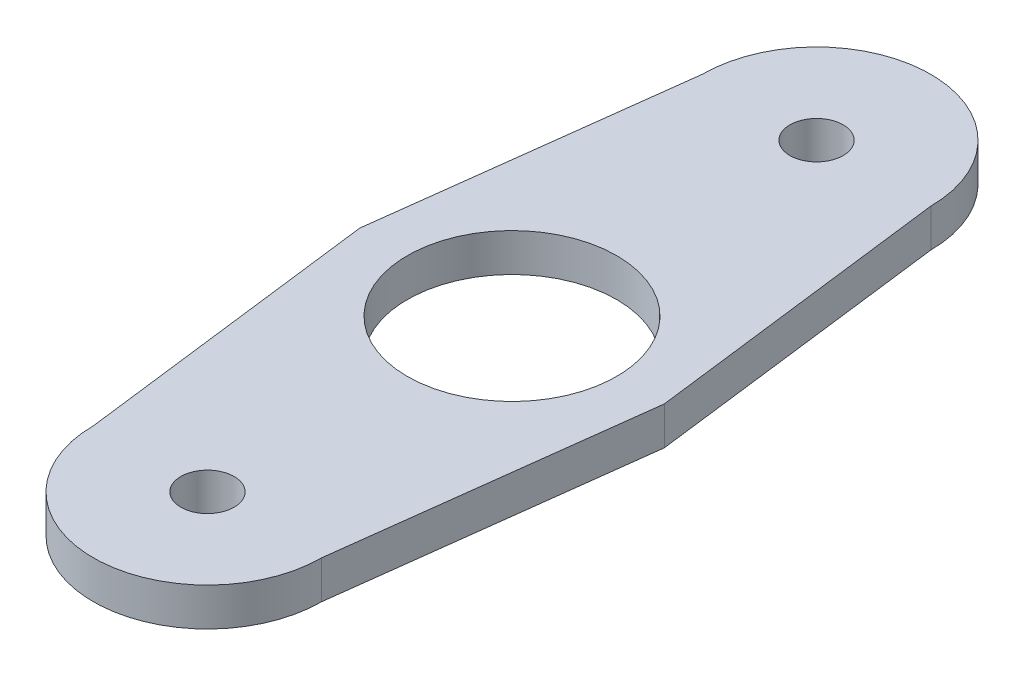
ISO-10303-21;
HEADER;
FILE_DESCRIPTION(('STEP AP214'),'2;1');
FILE_NAME('part.step','',(''),(''),'','','');
FILE_SCHEMA(('AUTOMOTIVE_DESIGN { 1 0 10303 214 1 1 1 1 }'));
ENDSEC;
DATA;
#1=APPLICATION_CONTEXT('core data for automotive mechanical design processes');
#2=APPLICATION_PROTOCOL_DEFINITION('international standard','automotive_design',2000,#1);
#3=PRODUCT_CONTEXT('',#1,'mechanical');
#4=PRODUCT('Part','Part','',(#3));
#5=PRODUCT_RELATED_PRODUCT_CATEGORY('part','',(#4));
#6=PRODUCT_DEFINITION_FORMATION('','',#4);
#7=PRODUCT_DEFINITION_CONTEXT('part definition',#1,'design');
#8=PRODUCT_DEFINITION('design','',#6,#7);
#9=PRODUCT_DEFINITION_SHAPE('','',#8);
#10=(LENGTH_UNIT() NAMED_UNIT(*) SI_UNIT(.MILLI.,.METRE.));
#11=(NAMED_UNIT(*) PLANE_ANGLE_UNIT() SI_UNIT($,.RADIAN.));
#12=(NAMED_UNIT(*) SI_UNIT($,.STERADIAN.) SOLID_ANGLE_UNIT());
#13=UNCERTAINTY_MEASURE_WITH_UNIT(LENGTH_MEASURE(1.E-05),#10,'distance_accuracy_value','');
#14=(GEOMETRIC_REPRESENTATION_CONTEXT(3) GLOBAL_UNCERTAINTY_ASSIGNED_CONTEXT((#13)) GLOBAL_UNIT_ASSIGNED_CONTEXT((#10,
#11,#12)) REPRESENTATION_CONTEXT('',''));
#15=CARTESIAN_POINT('',(0.,0.,0.));
#16=DIRECTION('',(0.,0.,1.));
#17=DIRECTION('',(1.,0.,0.));
#18=AXIS2_PLACEMENT_3D('',#15,#16,#17);
#19=CARTESIAN_POINT('',(0.,6.35,50.8));
#20=DIRECTION('',(0.,-1.,0.));
#21=DIRECTION('',(0.,0.,-1.));
#22=AXIS2_PLACEMENT_3D('',#19,#20,#21);
#23=CYLINDRICAL_SURFACE('',#22,4.445);
#24=CARTESIAN_POINT('',(0.,6.35,50.8));
#25=DIRECTION('',(0.,1.,0.));
#26=DIRECTION('',(0.,0.,1.));
#27=AXIS2_PLACEMENT_3D('',#24,#25,#26);
#28=CIRCLE('',#27,4.445);
#29=CARTESIAN_POINT('',(0.,6.35,55.245));
#30=VERTEX_POINT('',#29);
#31=EDGE_CURVE('E181',#30,#30,#28,.T.);
#32=ORIENTED_EDGE('',*,*,#31,.T.);
#33=EDGE_LOOP('',(#32));
#34=FACE_BOUND('',#33,.T.);
#35=CARTESIAN_POINT('',(0.,0.,50.8));
#36=DIRECTION('',(0.,1.,0.));
#37=DIRECTION('',(0.,0.,1.));
#38=AXIS2_PLACEMENT_3D('',#35,#36,#37);
#39=CIRCLE('',#38,4.445);
#40=CARTESIAN_POINT('',(0.,0.,55.245));
#41=VERTEX_POINT('',#40);
#42=EDGE_CURVE('E210',#41,#41,#39,.T.);
#43=ORIENTED_EDGE('',*,*,#42,.F.);
#44=EDGE_LOOP('',(#43));
#45=FACE_BOUND('',#44,.T.);
#46=ADVANCED_FACE('F94',(#34,#45),#23,.F.);
#47=CARTESIAN_POINT('',(0.,6.35,50.8));
#48=DIRECTION('',(0.,-1.,0.));
#49=DIRECTION('',(0.,0.,-1.));
#50=AXIS2_PLACEMENT_3D('',#47,#48,#49);
#51=CYLINDRICAL_SURFACE('',#50,19.05);
#52=CARTESIAN_POINT('',(0.,0.,50.8));
#53=DIRECTION('',(0.,1.,0.));
#54=DIRECTION('',(0.,0.,1.));
#55=AXIS2_PLACEMENT_3D('',#52,#53,#54);
#56=CIRCLE('',#55,19.05);
#57=CARTESIAN_POINT('',(-19.05,0.,50.8));
#58=VERTEX_POINT('',#57);
#59=CARTESIAN_POINT('',(19.05,0.,50.8));
#60=VERTEX_POINT('',#59);
#61=EDGE_CURVE('E196',#58,#60,#56,.T.);
#62=ORIENTED_EDGE('',*,*,#61,.T.);
#63=DIRECTION('',(0.,-1.,0.));
#64=VECTOR('',#63,1.);
#65=CARTESIAN_POINT('',(19.05,6.35,50.8));
#66=LINE('',#65,#64);
#67=CARTESIAN_POINT('',(19.05,6.35,50.8));
#68=VERTEX_POINT('',#67);
#69=EDGE_CURVE('E105',#68,#60,#66,.T.);
#70=ORIENTED_EDGE('',*,*,#69,.F.);
#71=CARTESIAN_POINT('',(0.,6.35,50.8));
#72=DIRECTION('',(0.,1.,0.));
#73=DIRECTION('',(0.,0.,1.));
#74=AXIS2_PLACEMENT_3D('',#71,#72,#73);
#75=CIRCLE('',#74,19.05);
#76=CARTESIAN_POINT('',(-19.05,6.35,50.8));
#77=VERTEX_POINT('',#76);
#78=EDGE_CURVE('E183',#77,#68,#75,.T.);
#79=ORIENTED_EDGE('',*,*,#78,.F.);
#80=DIRECTION('',(0.,-1.,0.));
#81=VECTOR('',#80,1.);
#82=CARTESIAN_POINT('',(-19.05,6.35,50.8));
#83=LINE('',#82,#81);
#84=EDGE_CURVE('E12',#77,#58,#83,.T.);
#85=ORIENTED_EDGE('',*,*,#84,.T.);
#86=EDGE_LOOP('',(#62,#70,#79,#85));
#87=FACE_BOUND('',#86,.T.);
#88=ADVANCED_FACE('F246',(#87),#51,.T.);
#89=CARTESIAN_POINT('',(25.0092307692308,6.35,3.12615384615384));
#90=DIRECTION('',(-0.992277876713668,0.,-0.124034734589208));
#91=DIRECTION('',(-0.124034734589208,0.,0.992277876713668));
#92=AXIS2_PLACEMENT_3D('',#89,#90,#91);
#93=PLANE('',#92);
#94=DIRECTION('',(0.124034734589208,0.,-0.992277876713668));
#95=VECTOR('',#94,1.);
#96=CARTESIAN_POINT('',(25.0092307692308,0.,3.12615384615384));
#97=LINE('',#96,#95);
#98=CARTESIAN_POINT('',(25.4,0.,0.));
#99=VERTEX_POINT('',#98);
#100=EDGE_CURVE('E200',#60,#99,#97,.T.);
#101=ORIENTED_EDGE('',*,*,#100,.T.);
#102=DIRECTION('',(0.,-1.,0.));
#103=VECTOR('',#102,1.);
#104=CARTESIAN_POINT('',(25.4,6.35,0.));
#105=LINE('',#104,#103);
#106=CARTESIAN_POINT('',(25.4,6.35,0.));
#107=VERTEX_POINT('',#106);
#108=EDGE_CURVE('E162',#107,#99,#105,.T.);
#109=ORIENTED_EDGE('',*,*,#108,.F.);
#110=DIRECTION('',(0.124034734589208,0.,-0.992277876713668));
#111=VECTOR('',#110,1.);
#112=CARTESIAN_POINT('',(25.0092307692308,6.35,3.12615384615384));
#113=LINE('',#112,#111);
#114=EDGE_CURVE('E174',#68,#107,#113,.T.);
#115=ORIENTED_EDGE('',*,*,#114,.F.);
#116=ORIENTED_EDGE('',*,*,#69,.T.);
#117=EDGE_LOOP('',(#101,#109,#115,#116));
#118=FACE_BOUND('',#117,.T.);
#119=ADVANCED_FACE('F252',(#118),#93,.F.);
#120=CARTESIAN_POINT('',(25.0092307692308,6.35,-3.12615384615385));
#121=DIRECTION('',(0.992277876713668,0.,-0.124034734589208));
#122=DIRECTION('',(-0.124034734589208,0.,-0.992277876713668));
#123=AXIS2_PLACEMENT_3D('',#120,#121,#122);
#124=PLANE('',#123);
#125=DIRECTION('',(0.124034734589208,0.,0.992277876713668));
#126=VECTOR('',#125,1.);
#127=CARTESIAN_POINT('',(25.0092307692308,0.,-3.12615384615385));
#128=LINE('',#127,#126);
#129=CARTESIAN_POINT('',(19.05,0.,-50.8));
#130=VERTEX_POINT('',#129);
#131=EDGE_CURVE('E158',#130,#99,#128,.T.);
#132=ORIENTED_EDGE('',*,*,#131,.F.);
#133=DIRECTION('',(0.,-1.,0.));
#134=VECTOR('',#133,1.);
#135=CARTESIAN_POINT('',(19.05,6.35,-50.8));
#136=LINE('',#135,#134);
#137=CARTESIAN_POINT('',(19.05,6.35,-50.8));
#138=VERTEX_POINT('',#137);
#139=EDGE_CURVE('E152',#138,#130,#136,.T.);
#140=ORIENTED_EDGE('',*,*,#139,.F.);
#141=DIRECTION('',(0.124034734589208,0.,0.992277876713668));
#142=VECTOR('',#141,1.);
#143=CARTESIAN_POINT('',(25.0092307692308,6.35,-3.12615384615385));
#144=LINE('',#143,#142);
#145=EDGE_CURVE('E156',#138,#107,#144,.T.);
#146=ORIENTED_EDGE('',*,*,#145,.T.);
#147=ORIENTED_EDGE('',*,*,#108,.T.);
#148=EDGE_LOOP('',(#132,#140,#146,#147));
#149=FACE_BOUND('',#148,.T.);
#150=ADVANCED_FACE('F154',(#149),#124,.T.);
#151=CARTESIAN_POINT('',(-25.0092307692308,6.35,-3.12615384615382));
#152=DIRECTION('',(-0.992277876713668,0.,-0.124034734589208));
#153=DIRECTION('',(-0.124034734589208,0.,0.992277876713668));
#154=AXIS2_PLACEMENT_3D('',#151,#152,#153);
#155=PLANE('',#154);
#156=DIRECTION('',(0.124034734589208,0.,-0.992277876713668));
#157=VECTOR('',#156,1.);
#158=CARTESIAN_POINT('',(-25.0092307692308,0.,-3.12615384615382));
#159=LINE('',#158,#157);
#160=CARTESIAN_POINT('',(-25.4,0.,0.));
#161=VERTEX_POINT('',#160);
#162=CARTESIAN_POINT('',(-19.05,0.,-50.8));
#163=VERTEX_POINT('',#162);
#164=EDGE_CURVE('E206',#161,#163,#159,.T.);
#165=ORIENTED_EDGE('',*,*,#164,.F.);
#166=DIRECTION('',(0.,-1.,0.));
#167=VECTOR('',#166,1.);
#168=CARTESIAN_POINT('',(-25.4,6.35,0.));
#169=LINE('',#168,#167);
#170=CARTESIAN_POINT('',(-25.4,6.35,0.));
#171=VERTEX_POINT('',#170);
#172=EDGE_CURVE('E114',#171,#161,#169,.T.);
#173=ORIENTED_EDGE('',*,*,#172,.F.);
#174=DIRECTION('',(0.124034734589208,0.,-0.992277876713668));
#175=VECTOR('',#174,1.);
#176=CARTESIAN_POINT('',(-25.0092307692308,6.35,-3.12615384615382));
#177=LINE('',#176,#175);
#178=CARTESIAN_POINT('',(-19.05,6.35,-50.8));
#179=VERTEX_POINT('',#178);
#180=EDGE_CURVE('E177',#171,#179,#177,.T.);
#181=ORIENTED_EDGE('',*,*,#180,.T.);
#182=DIRECTION('',(0.,-1.,0.));
#183=VECTOR('',#182,1.);
#184=CARTESIAN_POINT('',(-19.05,6.35,-50.8));
#185=LINE('',#184,#183);
#186=EDGE_CURVE('E133',#179,#163,#185,.T.);
#187=ORIENTED_EDGE('',*,*,#186,.T.);
#188=EDGE_LOOP('',(#165,#173,#181,#187));
#189=FACE_BOUND('',#188,.T.);
#190=ADVANCED_FACE('F258',(#189),#155,.T.);
#191=CARTESIAN_POINT('',(-25.0092307692308,6.35,3.12615384615384));
#192=DIRECTION('',(-0.992277876713668,0.,0.124034734589208));
#193=DIRECTION('',(0.124034734589208,0.,0.992277876713668));
#194=AXIS2_PLACEMENT_3D('',#191,#192,#193);
#195=PLANE('',#194);
#196=DIRECTION('',(-0.124034734589208,0.,-0.992277876713668));
#197=VECTOR('',#196,1.);
#198=CARTESIAN_POINT('',(-25.0092307692308,0.,3.12615384615384));
#199=LINE('',#198,#197);
#200=EDGE_CURVE('E193',#58,#161,#199,.T.);
#201=ORIENTED_EDGE('',*,*,#200,.F.);
#202=ORIENTED_EDGE('',*,*,#84,.F.);
#203=DIRECTION('',(-0.124034734589208,0.,-0.992277876713668));
#204=VECTOR('',#203,1.);
#205=CARTESIAN_POINT('',(-25.0092307692308,6.35,3.12615384615384));
#206=LINE('',#205,#204);
#207=EDGE_CURVE('E285',#77,#171,#206,.T.);
#208=ORIENTED_EDGE('',*,*,#207,.T.);
#209=ORIENTED_EDGE('',*,*,#172,.T.);
#210=EDGE_LOOP('',(#201,#202,#208,#209));
#211=FACE_BOUND('',#210,.T.);
#212=ADVANCED_FACE('F261',(#211),#195,.T.);
#213=CARTESIAN_POINT('',(0.,6.35,0.));
#214=DIRECTION('',(0.,-1.,0.));
#215=DIRECTION('',(0.,0.,-1.));
#216=AXIS2_PLACEMENT_3D('',#213,#214,#215);
#217=CYLINDRICAL_SURFACE('',#216,17.4625);
#218=CARTESIAN_POINT('',(0.,6.35,0.));
#219=DIRECTION('',(0.,1.,0.));
#220=DIRECTION('',(0.,0.,1.));
#221=AXIS2_PLACEMENT_3D('',#218,#219,#220);
#222=CIRCLE('',#221,17.4625);
#223=CARTESIAN_POINT('',(0.,6.35,17.4625));
#224=VERTEX_POINT('',#223);
#225=EDGE_CURVE('E214',#224,#224,#222,.T.);
#226=ORIENTED_EDGE('',*,*,#225,.T.);
#227=EDGE_LOOP('',(#226));
#228=FACE_BOUND('',#227,.T.);
#229=CARTESIAN_POINT('',(0.,0.,0.));
#230=DIRECTION('',(0.,1.,0.));
#231=DIRECTION('',(0.,0.,1.));
#232=AXIS2_PLACEMENT_3D('',#229,#230,#231);
#233=CIRCLE('',#232,17.4625);
#234=CARTESIAN_POINT('',(0.,0.,17.4625));
#235=VERTEX_POINT('',#234);
#236=EDGE_CURVE('E169',#235,#235,#233,.T.);
#237=ORIENTED_EDGE('',*,*,#236,.F.);
#238=EDGE_LOOP('',(#237));
#239=FACE_BOUND('',#238,.T.);
#240=ADVANCED_FACE('F268',(#228,#239),#217,.F.);
#241=CARTESIAN_POINT('',(0.,0.,0.));
#242=DIRECTION('',(0.,1.,0.));
#243=DIRECTION('',(0.,0.,1.));
#244=AXIS2_PLACEMENT_3D('',#241,#242,#243);
#245=PLANE('',#244);
#246=ORIENTED_EDGE('',*,*,#236,.T.);
#247=EDGE_LOOP('',(#246));
#248=FACE_BOUND('',#247,.T.);
#249=ORIENTED_EDGE('',*,*,#200,.T.);
#250=ORIENTED_EDGE('',*,*,#164,.T.);
#251=CARTESIAN_POINT('',(0.,0.,-50.8));
#252=DIRECTION('',(0.,1.,0.));
#253=DIRECTION('',(0.,0.,1.));
#254=AXIS2_PLACEMENT_3D('',#251,#252,#253);
#255=CIRCLE('',#254,19.05);
#256=EDGE_CURVE('E98',#130,#163,#255,.T.);
#257=ORIENTED_EDGE('',*,*,#256,.F.);
#258=ORIENTED_EDGE('',*,*,#131,.T.);
#259=ORIENTED_EDGE('',*,*,#100,.F.);
#260=ORIENTED_EDGE('',*,*,#61,.F.);
#261=EDGE_LOOP('',(#249,#250,#257,#258,#259,#260));
#262=FACE_BOUND('',#261,.T.);
#263=ORIENTED_EDGE('',*,*,#42,.T.);
#264=EDGE_LOOP('',(#263));
#265=FACE_BOUND('',#264,.T.);
#266=CARTESIAN_POINT('',(0.,0.,-50.8));
#267=DIRECTION('',(0.,1.,0.));
#268=DIRECTION('',(0.,0.,1.));
#269=AXIS2_PLACEMENT_3D('',#266,#267,#268);
#270=CIRCLE('',#269,4.445);
#271=CARTESIAN_POINT('',(0.,0.,-46.355));
#272=VERTEX_POINT('',#271);
#273=EDGE_CURVE('E228',#272,#272,#270,.T.);
#274=ORIENTED_EDGE('',*,*,#273,.T.);
#275=EDGE_LOOP('',(#274));
#276=FACE_BOUND('',#275,.T.);
#277=ADVANCED_FACE('F233',(#248,#262,#265,#276),#245,.F.);
#278=CARTESIAN_POINT('',(0.,6.35,0.));
#279=DIRECTION('',(0.,1.,0.));
#280=DIRECTION('',(0.,0.,1.));
#281=AXIS2_PLACEMENT_3D('',#278,#279,#280);
#282=PLANE('',#281);
#283=ORIENTED_EDGE('',*,*,#225,.F.);
#284=EDGE_LOOP('',(#283));
#285=FACE_BOUND('',#284,.T.);
#286=ORIENTED_EDGE('',*,*,#207,.F.);
#287=ORIENTED_EDGE('',*,*,#78,.T.);
#288=ORIENTED_EDGE('',*,*,#114,.T.);
#289=ORIENTED_EDGE('',*,*,#145,.F.);
#290=CARTESIAN_POINT('',(0.,6.35,-50.8));
#291=DIRECTION('',(0.,1.,0.));
#292=DIRECTION('',(0.,0.,1.));
#293=AXIS2_PLACEMENT_3D('',#290,#291,#292);
#294=CIRCLE('',#293,19.05);
#295=EDGE_CURVE('E165',#138,#179,#294,.T.);
#296=ORIENTED_EDGE('',*,*,#295,.T.);
#297=ORIENTED_EDGE('',*,*,#180,.F.);
#298=EDGE_LOOP('',(#286,#287,#288,#289,#296,#297));
#299=FACE_BOUND('',#298,.T.);
#300=ORIENTED_EDGE('',*,*,#31,.F.);
#301=EDGE_LOOP('',(#300));
#302=FACE_BOUND('',#301,.T.);
#303=CARTESIAN_POINT('',(0.,6.35,-50.8));
#304=DIRECTION('',(0.,1.,0.));
#305=DIRECTION('',(0.,0.,1.));
#306=AXIS2_PLACEMENT_3D('',#303,#304,#305);
#307=CIRCLE('',#306,4.445);
#308=CARTESIAN_POINT('',(0.,6.35,-46.355));
#309=VERTEX_POINT('',#308);
#310=EDGE_CURVE('E224',#309,#309,#307,.T.);
#311=ORIENTED_EDGE('',*,*,#310,.F.);
#312=EDGE_LOOP('',(#311));
#313=FACE_BOUND('',#312,.T.);
#314=ADVANCED_FACE('F171',(#285,#299,#302,#313),#282,.T.);
#315=CARTESIAN_POINT('',(0.,6.35,-50.8));
#316=DIRECTION('',(0.,-1.,0.));
#317=DIRECTION('',(0.,0.,-1.));
#318=AXIS2_PLACEMENT_3D('',#315,#316,#317);
#319=CYLINDRICAL_SURFACE('',#318,4.445);
#320=ORIENTED_EDGE('',*,*,#310,.T.);
#321=EDGE_LOOP('',(#320));
#322=FACE_BOUND('',#321,.T.);
#323=ORIENTED_EDGE('',*,*,#273,.F.);
#324=EDGE_LOOP('',(#323));
#325=FACE_BOUND('',#324,.T.);
#326=ADVANCED_FACE('F235',(#322,#325),#319,.F.);
#327=CARTESIAN_POINT('',(0.,6.35,-50.8));
#328=DIRECTION('',(0.,-1.,0.));
#329=DIRECTION('',(0.,0.,-1.));
#330=AXIS2_PLACEMENT_3D('',#327,#328,#329);
#331=CYLINDRICAL_SURFACE('',#330,19.05);
#332=ORIENTED_EDGE('',*,*,#139,.T.);
#333=ORIENTED_EDGE('',*,*,#256,.T.);
#334=ORIENTED_EDGE('',*,*,#186,.F.);
#335=ORIENTED_EDGE('',*,*,#295,.F.);
#336=EDGE_LOOP('',(#332,#333,#334,#335));
#337=FACE_BOUND('',#336,.T.);
#338=ADVANCED_FACE('F96',(#337),#331,.T.);
#339=CLOSED_SHELL('',(#46,#88,#119,#150,#190,#212,#240,#277,#314,#326,#338));
#340=MANIFOLD_SOLID_BREP('B2',#339);
#341=ADVANCED_BREP_SHAPE_REPRESENTATION('',(#18,#340),#14);
#342=SHAPE_DEFINITION_REPRESENTATION(#9,#341);
ENDSEC;
END-ISO-10303-21;
